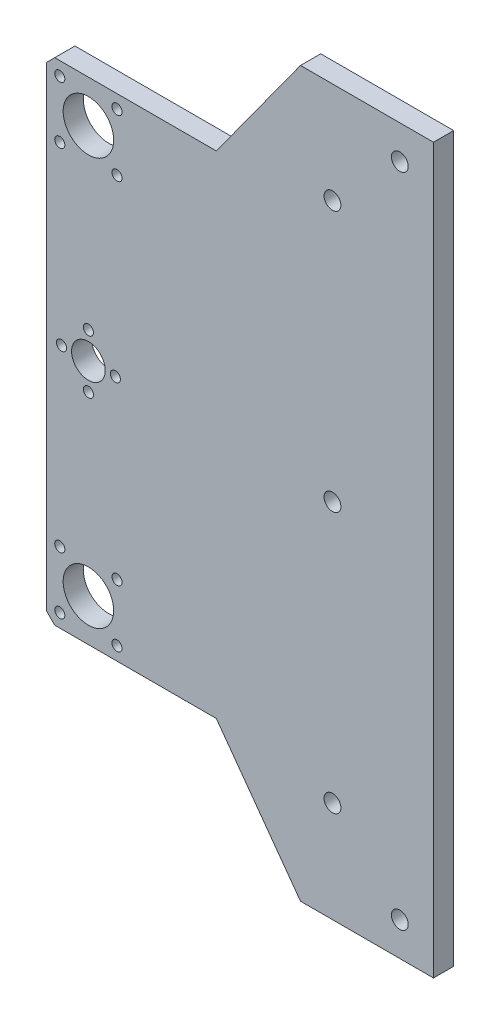
ISO-10303-21;
HEADER;
FILE_DESCRIPTION(('STEP AP214'),'2;1');
FILE_NAME('part.step','',(''),(''),'','','');
FILE_SCHEMA(('AUTOMOTIVE_DESIGN { 1 0 10303 214 1 1 1 1 }'));
ENDSEC;
DATA;
#1=APPLICATION_CONTEXT('core data for automotive mechanical design processes');
#2=APPLICATION_PROTOCOL_DEFINITION('international standard','automotive_design',2000,#1);
#3=PRODUCT_CONTEXT('',#1,'mechanical');
#4=PRODUCT('Part','Part','',(#3));
#5=PRODUCT_RELATED_PRODUCT_CATEGORY('part','',(#4));
#6=PRODUCT_DEFINITION_FORMATION('','',#4);
#7=PRODUCT_DEFINITION_CONTEXT('part definition',#1,'design');
#8=PRODUCT_DEFINITION('design','',#6,#7);
#9=PRODUCT_DEFINITION_SHAPE('','',#8);
#10=(LENGTH_UNIT() NAMED_UNIT(*) SI_UNIT(.MILLI.,.METRE.));
#11=(NAMED_UNIT(*) PLANE_ANGLE_UNIT() SI_UNIT($,.RADIAN.));
#12=(NAMED_UNIT(*) SI_UNIT($,.STERADIAN.) SOLID_ANGLE_UNIT());
#13=UNCERTAINTY_MEASURE_WITH_UNIT(LENGTH_MEASURE(1.E-05),#10,'distance_accuracy_value','');
#14=(GEOMETRIC_REPRESENTATION_CONTEXT(3) GLOBAL_UNCERTAINTY_ASSIGNED_CONTEXT((#13)) GLOBAL_UNIT_ASSIGNED_CONTEXT((#10,
#11,#12)) REPRESENTATION_CONTEXT('',''));
#15=CARTESIAN_POINT('',(0.,0.,0.));
#16=DIRECTION('',(0.,0.,1.));
#17=DIRECTION('',(1.,0.,0.));
#18=AXIS2_PLACEMENT_3D('',#15,#16,#17);
#19=CARTESIAN_POINT('',(-118.720197344261,118.720312676004,6.));
#20=DIRECTION('',(-0.707106437724189,0.707107124648739,0.));
#21=DIRECTION('',(-0.707107124648739,-0.707106437724189,0.));
#22=AXIS2_PLACEMENT_3D('',#19,#20,#21);
#23=PLANE('',#22);
#24=DIRECTION('',(0.707107124648739,0.707106437724189,0.));
#25=VECTOR('',#24,1.);
#26=CARTESIAN_POINT('',(-118.720197344261,118.720312676004,0.));
#27=LINE('',#26,#25);
#28=CARTESIAN_POINT('',(-114.885002048852,122.555504245684,0.));
#29=VERTEX_POINT('',#28);
#30=CARTESIAN_POINT('',(-112.385001966847,125.055501899045,0.));
#31=VERTEX_POINT('',#30);
#32=EDGE_CURVE('E236',#29,#31,#27,.T.);
#33=ORIENTED_EDGE('',*,*,#32,.F.);
#34=DIRECTION('',(0.,0.,-1.));
#35=VECTOR('',#34,1.);
#36=CARTESIAN_POINT('',(-114.885002048852,122.555504245684,6.));
#37=LINE('',#36,#35);
#38=CARTESIAN_POINT('',(-114.885002048852,122.555504245684,6.));
#39=VERTEX_POINT('',#38);
#40=EDGE_CURVE('E11',#39,#29,#37,.T.);
#41=ORIENTED_EDGE('',*,*,#40,.F.);
#42=DIRECTION('',(0.707107124648739,0.707106437724189,0.));
#43=VECTOR('',#42,1.);
#44=CARTESIAN_POINT('',(-118.720197344261,118.720312676004,6.));
#45=LINE('',#44,#43);
#46=CARTESIAN_POINT('',(-112.385001966847,125.055501899045,6.));
#47=VERTEX_POINT('',#46);
#48=EDGE_CURVE('E695',#39,#47,#45,.T.);
#49=ORIENTED_EDGE('',*,*,#48,.T.);
#50=DIRECTION('',(0.,0.,-1.));
#51=VECTOR('',#50,1.);
#52=CARTESIAN_POINT('',(-112.385001966847,125.055501899045,6.));
#53=LINE('',#52,#51);
#54=EDGE_CURVE('E59',#47,#31,#53,.T.);
#55=ORIENTED_EDGE('',*,*,#54,.T.);
#56=EDGE_LOOP('',(#33,#41,#49,#55));
#57=FACE_BOUND('',#56,.T.);
#58=ADVANCED_FACE('F41',(#57),#23,.T.);
#59=CARTESIAN_POINT('',(-114.885002048852,0.,6.));
#60=DIRECTION('',(1.,0.,0.));
#61=DIRECTION('',(0.,1.,0.));
#62=AXIS2_PLACEMENT_3D('',#59,#60,#61);
#63=PLANE('',#62);
#64=DIRECTION('',(0.,-1.,0.));
#65=VECTOR('',#64,1.);
#66=CARTESIAN_POINT('',(-114.885002048852,0.,0.));
#67=LINE('',#66,#65);
#68=CARTESIAN_POINT('',(-114.885002048852,-18.4444983769208,0.));
#69=VERTEX_POINT('',#68);
#70=EDGE_CURVE('E239',#29,#69,#67,.T.);
#71=ORIENTED_EDGE('',*,*,#70,.T.);
#72=DIRECTION('',(0.,0.,-1.));
#73=VECTOR('',#72,1.);
#74=CARTESIAN_POINT('',(-114.885002048852,-18.4444983769208,6.));
#75=LINE('',#74,#73);
#76=CARTESIAN_POINT('',(-114.885002048852,-18.4444983769208,6.));
#77=VERTEX_POINT('',#76);
#78=EDGE_CURVE('E51',#77,#69,#75,.T.);
#79=ORIENTED_EDGE('',*,*,#78,.F.);
#80=DIRECTION('',(0.,-1.,0.));
#81=VECTOR('',#80,1.);
#82=CARTESIAN_POINT('',(-114.885002048852,0.,6.));
#83=LINE('',#82,#81);
#84=EDGE_CURVE('E688',#39,#77,#83,.T.);
#85=ORIENTED_EDGE('',*,*,#84,.F.);
#86=ORIENTED_EDGE('',*,*,#40,.T.);
#87=EDGE_LOOP('',(#71,#79,#85,#86));
#88=FACE_BOUND('',#87,.T.);
#89=ADVANCED_FACE('F318',(#88),#63,.F.);
#90=CARTESIAN_POINT('',(-66.6647831207348,-66.6647449296042,6.));
#91=DIRECTION('',(0.707106983731355,0.707106578641682,0.));
#92=DIRECTION('',(-0.707106578641682,0.707106983731355,0.));
#93=AXIS2_PLACEMENT_3D('',#90,#91,#92);
#94=PLANE('',#93);
#95=DIRECTION('',(0.707106578641682,-0.707106983731355,0.));
#96=VECTOR('',#95,1.);
#97=CARTESIAN_POINT('',(-66.6647831207348,-66.6647449296042,0.));
#98=LINE('',#97,#96);
#99=CARTESIAN_POINT('',(-112.385002139956,-20.9444997180253,0.));
#100=VERTEX_POINT('',#99);
#101=EDGE_CURVE('E243',#69,#100,#98,.T.);
#102=ORIENTED_EDGE('',*,*,#101,.T.);
#103=DIRECTION('',(0.,0.,-1.));
#104=VECTOR('',#103,1.);
#105=CARTESIAN_POINT('',(-112.385002139956,-20.9444997180253,6.));
#106=LINE('',#105,#104);
#107=CARTESIAN_POINT('',(-112.385002139956,-20.9444997180253,6.));
#108=VERTEX_POINT('',#107);
#109=EDGE_CURVE('E306',#108,#100,#106,.T.);
#110=ORIENTED_EDGE('',*,*,#109,.F.);
#111=DIRECTION('',(0.707106578641682,-0.707106983731355,0.));
#112=VECTOR('',#111,1.);
#113=CARTESIAN_POINT('',(-66.6647831207348,-66.6647449296042,6.));
#114=LINE('',#113,#112);
#115=EDGE_CURVE('E314',#77,#108,#114,.T.);
#116=ORIENTED_EDGE('',*,*,#115,.F.);
#117=ORIENTED_EDGE('',*,*,#78,.T.);
#118=EDGE_LOOP('',(#102,#110,#116,#117));
#119=FACE_BOUND('',#118,.T.);
#120=ADVANCED_FACE('F312',(#119),#94,.F.);
#121=CARTESIAN_POINT('',(0.,-20.9444997180253,6.));
#122=DIRECTION('',(0.,-1.,0.));
#123=DIRECTION('',(0.,0.,-1.));
#124=AXIS2_PLACEMENT_3D('',#121,#122,#123);
#125=PLANE('',#124);
#126=DIRECTION('',(-1.,0.,0.));
#127=VECTOR('',#126,1.);
#128=CARTESIAN_POINT('',(0.,-20.9444997180253,0.));
#129=LINE('',#128,#127);
#130=CARTESIAN_POINT('',(-64.3850003257394,-20.9444997180253,0.));
#131=VERTEX_POINT('',#130);
#132=EDGE_CURVE('E247',#131,#100,#129,.T.);
#133=ORIENTED_EDGE('',*,*,#132,.F.);
#134=DIRECTION('',(0.,0.,-1.));
#135=VECTOR('',#134,1.);
#136=CARTESIAN_POINT('',(-64.3850003257394,-20.9444997180253,6.));
#137=LINE('',#136,#135);
#138=CARTESIAN_POINT('',(-64.3850003257394,-20.9444997180253,6.));
#139=VERTEX_POINT('',#138);
#140=EDGE_CURVE('E303',#139,#131,#137,.T.);
#141=ORIENTED_EDGE('',*,*,#140,.F.);
#142=DIRECTION('',(-1.,0.,0.));
#143=VECTOR('',#142,1.);
#144=CARTESIAN_POINT('',(0.,-20.9444997180253,6.));
#145=LINE('',#144,#143);
#146=EDGE_CURVE('E683',#139,#108,#145,.T.);
#147=ORIENTED_EDGE('',*,*,#146,.T.);
#148=ORIENTED_EDGE('',*,*,#109,.T.);
#149=EDGE_LOOP('',(#133,#141,#147,#148));
#150=FACE_BOUND('',#149,.T.);
#151=ADVANCED_FACE('F483',(#150),#125,.T.);
#152=CARTESIAN_POINT('',(-52.1685009762058,-37.8032665863785,6.));
#153=DIRECTION('',(0.809749805832477,0.586775299372992,0.));
#154=DIRECTION('',(-0.586775299372992,0.809749805832478,0.));
#155=AXIS2_PLACEMENT_3D('',#152,#153,#154);
#156=PLANE('',#155);
#157=DIRECTION('',(0.586775299372992,-0.809749805832478,0.));
#158=VECTOR('',#157,1.);
#159=CARTESIAN_POINT('',(-52.1685009762058,-37.8032665863785,0.));
#160=LINE('',#159,#158);
#161=CARTESIAN_POINT('',(-39.3849980905652,-55.4444982308727,0.));
#162=VERTEX_POINT('',#161);
#163=EDGE_CURVE('E251',#131,#162,#160,.T.);
#164=ORIENTED_EDGE('',*,*,#163,.T.);
#165=DIRECTION('',(0.,0.,-1.));
#166=VECTOR('',#165,1.);
#167=CARTESIAN_POINT('',(-39.3849980905652,-55.4444982308727,6.));
#168=LINE('',#167,#166);
#169=CARTESIAN_POINT('',(-39.3849980905652,-55.4444982308727,6.));
#170=VERTEX_POINT('',#169);
#171=EDGE_CURVE('E299',#170,#162,#168,.T.);
#172=ORIENTED_EDGE('',*,*,#171,.F.);
#173=DIRECTION('',(0.586775299372992,-0.809749805832478,0.));
#174=VECTOR('',#173,1.);
#175=CARTESIAN_POINT('',(-52.1685009762058,-37.8032665863785,6.));
#176=LINE('',#175,#174);
#177=EDGE_CURVE('E680',#139,#170,#176,.T.);
#178=ORIENTED_EDGE('',*,*,#177,.F.);
#179=ORIENTED_EDGE('',*,*,#140,.T.);
#180=EDGE_LOOP('',(#164,#172,#178,#179));
#181=FACE_BOUND('',#180,.T.);
#182=ADVANCED_FACE('F479',(#181),#156,.F.);
#183=CARTESIAN_POINT('',(0.,-55.4444982308727,6.));
#184=DIRECTION('',(0.,1.,0.));
#185=DIRECTION('',(0.,0.,1.));
#186=AXIS2_PLACEMENT_3D('',#183,#184,#185);
#187=PLANE('',#186);
#188=DIRECTION('',(1.,0.,0.));
#189=VECTOR('',#188,1.);
#190=CARTESIAN_POINT('',(0.,-55.4444982308727,0.));
#191=LINE('',#190,#189);
#192=CARTESIAN_POINT('',(0.115000002086169,-55.4444982308727,0.));
#193=VERTEX_POINT('',#192);
#194=EDGE_CURVE('E255',#162,#193,#191,.T.);
#195=ORIENTED_EDGE('',*,*,#194,.T.);
#196=DIRECTION('',(0.,0.,-1.));
#197=VECTOR('',#196,1.);
#198=CARTESIAN_POINT('',(0.115000002086169,-55.4444982308727,6.));
#199=LINE('',#198,#197);
#200=CARTESIAN_POINT('',(0.115000002086169,-55.4444982308727,6.));
#201=VERTEX_POINT('',#200);
#202=EDGE_CURVE('E295',#201,#193,#199,.T.);
#203=ORIENTED_EDGE('',*,*,#202,.F.);
#204=DIRECTION('',(1.,0.,0.));
#205=VECTOR('',#204,1.);
#206=CARTESIAN_POINT('',(0.,-55.4444982308727,6.));
#207=LINE('',#206,#205);
#208=EDGE_CURVE('E150',#170,#201,#207,.T.);
#209=ORIENTED_EDGE('',*,*,#208,.F.);
#210=ORIENTED_EDGE('',*,*,#171,.T.);
#211=EDGE_LOOP('',(#195,#203,#209,#210));
#212=FACE_BOUND('',#211,.T.);
#213=ADVANCED_FACE('F475',(#212),#187,.F.);
#214=CARTESIAN_POINT('',(0.115000002086169,0.,6.));
#215=DIRECTION('',(-1.,0.,0.));
#216=DIRECTION('',(0.,0.,1.));
#217=AXIS2_PLACEMENT_3D('',#214,#215,#216);
#218=PLANE('',#217);
#219=DIRECTION('',(0.,1.,0.));
#220=VECTOR('',#219,1.);
#221=CARTESIAN_POINT('',(0.115000002086169,0.,0.));
#222=LINE('',#221,#220);
#223=CARTESIAN_POINT('',(0.115000002086169,159.555504760068,0.));
#224=VERTEX_POINT('',#223);
#225=EDGE_CURVE('E259',#193,#224,#222,.T.);
#226=ORIENTED_EDGE('',*,*,#225,.T.);
#227=DIRECTION('',(0.,0.,-1.));
#228=VECTOR('',#227,1.);
#229=CARTESIAN_POINT('',(0.115000002086169,159.555504760068,6.));
#230=LINE('',#229,#228);
#231=CARTESIAN_POINT('',(0.115000002086169,159.555504760068,6.));
#232=VERTEX_POINT('',#231);
#233=EDGE_CURVE('E132',#232,#224,#230,.T.);
#234=ORIENTED_EDGE('',*,*,#233,.F.);
#235=DIRECTION('',(0.,1.,0.));
#236=VECTOR('',#235,1.);
#237=CARTESIAN_POINT('',(0.115000002086169,0.,6.));
#238=LINE('',#237,#236);
#239=EDGE_CURVE('E145',#201,#232,#238,.T.);
#240=ORIENTED_EDGE('',*,*,#239,.F.);
#241=ORIENTED_EDGE('',*,*,#202,.T.);
#242=EDGE_LOOP('',(#226,#234,#240,#241));
#243=FACE_BOUND('',#242,.T.);
#244=ADVANCED_FACE('F472',(#243),#218,.F.);
#245=CARTESIAN_POINT('',(0.,159.555504760068,6.));
#246=DIRECTION('',(0.,1.,0.));
#247=DIRECTION('',(0.,0.,1.));
#248=AXIS2_PLACEMENT_3D('',#245,#246,#247);
#249=PLANE('',#248);
#250=DIRECTION('',(1.,0.,0.));
#251=VECTOR('',#250,1.);
#252=CARTESIAN_POINT('',(0.,159.555504760068,0.));
#253=LINE('',#252,#251);
#254=CARTESIAN_POINT('',(-39.3850002457624,159.555504760068,0.));
#255=VERTEX_POINT('',#254);
#256=EDGE_CURVE('E128',#255,#224,#253,.T.);
#257=ORIENTED_EDGE('',*,*,#256,.F.);
#258=DIRECTION('',(0.,0.,-1.));
#259=VECTOR('',#258,1.);
#260=CARTESIAN_POINT('',(-39.3850002457624,159.555504760068,6.));
#261=LINE('',#260,#259);
#262=CARTESIAN_POINT('',(-39.3850002457624,159.555504760068,6.));
#263=VERTEX_POINT('',#262);
#264=EDGE_CURVE('E122',#263,#255,#261,.T.);
#265=ORIENTED_EDGE('',*,*,#264,.F.);
#266=DIRECTION('',(1.,0.,0.));
#267=VECTOR('',#266,1.);
#268=CARTESIAN_POINT('',(0.,159.555504760068,6.));
#269=LINE('',#268,#267);
#270=EDGE_CURVE('E126',#263,#232,#269,.T.);
#271=ORIENTED_EDGE('',*,*,#270,.T.);
#272=ORIENTED_EDGE('',*,*,#233,.T.);
#273=EDGE_LOOP('',(#257,#265,#271,#272));
#274=FACE_BOUND('',#273,.T.);
#275=ADVANCED_FACE('F124',(#274),#249,.T.);
#276=CARTESIAN_POINT('',(-101.635928641547,73.6492241304512,6.));
#277=DIRECTION('',(0.809749840970915,-0.586775250881952,0.));
#278=DIRECTION('',(0.586775250881952,0.809749840970915,0.));
#279=AXIS2_PLACEMENT_3D('',#276,#277,#278);
#280=PLANE('',#279);
#281=DIRECTION('',(-0.586775250881952,-0.809749840970915,0.));
#282=VECTOR('',#281,1.);
#283=CARTESIAN_POINT('',(-101.635928641547,73.6492241304512,0.));
#284=LINE('',#283,#282);
#285=CARTESIAN_POINT('',(-64.3850024809365,125.055501899045,0.));
#286=VERTEX_POINT('',#285);
#287=EDGE_CURVE('E265',#255,#286,#284,.T.);
#288=ORIENTED_EDGE('',*,*,#287,.T.);
#289=DIRECTION('',(0.,0.,-1.));
#290=VECTOR('',#289,1.);
#291=CARTESIAN_POINT('',(-64.3850024809365,125.055501899045,6.));
#292=LINE('',#291,#290);
#293=CARTESIAN_POINT('',(-64.3850024809365,125.055501899045,6.));
#294=VERTEX_POINT('',#293);
#295=EDGE_CURVE('E91',#294,#286,#292,.T.);
#296=ORIENTED_EDGE('',*,*,#295,.F.);
#297=DIRECTION('',(-0.586775250881952,-0.809749840970915,0.));
#298=VECTOR('',#297,1.);
#299=CARTESIAN_POINT('',(-101.635928641547,73.6492241304512,6.));
#300=LINE('',#299,#298);
#301=EDGE_CURVE('E134',#263,#294,#300,.T.);
#302=ORIENTED_EDGE('',*,*,#301,.F.);
#303=ORIENTED_EDGE('',*,*,#264,.T.);
#304=EDGE_LOOP('',(#288,#296,#302,#303));
#305=FACE_BOUND('',#304,.T.);
#306=ADVANCED_FACE('F135',(#305),#280,.F.);
#307=CARTESIAN_POINT('',(-102.385001897812,112.555506331846,6.));
#308=DIRECTION('',(0.,0.,-1.));
#309=DIRECTION('',(-1.,0.,0.));
#310=AXIS2_PLACEMENT_3D('',#307,#308,#309);
#311=CYLINDRICAL_SURFACE('',#310,7.49999945033653);
#312=CARTESIAN_POINT('',(-102.385001897812,112.555506331846,6.));
#313=DIRECTION('',(0.,0.,1.));
#314=DIRECTION('',(1.,0.,0.));
#315=AXIS2_PLACEMENT_3D('',#312,#313,#314);
#316=CIRCLE('',#315,7.49999945033653);
#317=CARTESIAN_POINT('',(-94.8850024474753,112.555506331846,6.));
#318=VERTEX_POINT('',#317);
#319=EDGE_CURVE('E164',#318,#318,#316,.F.);
#320=ORIENTED_EDGE('',*,*,#319,.F.);
#321=EDGE_LOOP('',(#320));
#322=FACE_BOUND('',#321,.T.);
#323=CARTESIAN_POINT('',(-102.385001897812,112.555506331846,0.));
#324=DIRECTION('',(0.,0.,1.));
#325=DIRECTION('',(1.,0.,0.));
#326=AXIS2_PLACEMENT_3D('',#323,#324,#325);
#327=CIRCLE('',#326,7.49999945033653);
#328=CARTESIAN_POINT('',(-94.8850024474753,112.555506331846,0.));
#329=VERTEX_POINT('',#328);
#330=EDGE_CURVE('E280',#329,#329,#327,.F.);
#331=ORIENTED_EDGE('',*,*,#330,.T.);
#332=EDGE_LOOP('',(#331));
#333=FACE_BOUND('',#332,.T.);
#334=ADVANCED_FACE('F454',(#322,#333),#311,.F.);
#335=CARTESIAN_POINT('',(-93.8850023671984,121.055504931137,6.));
#336=DIRECTION('',(0.,0.,-1.));
#337=DIRECTION('',(-1.,0.,0.));
#338=AXIS2_PLACEMENT_3D('',#335,#336,#337);
#339=CYLINDRICAL_SURFACE('',#338,1.50000026356073);
#340=CARTESIAN_POINT('',(-93.8850023671984,121.055504931137,6.));
#341=DIRECTION('',(0.,0.,1.));
#342=DIRECTION('',(1.,0.,0.));
#343=AXIS2_PLACEMENT_3D('',#340,#341,#342);
#344=CIRCLE('',#343,1.50000026356073);
#345=CARTESIAN_POINT('',(-92.3850021036377,121.055504931137,6.));
#346=VERTEX_POINT('',#345);
#347=EDGE_CURVE('E160',#346,#346,#344,.F.);
#348=ORIENTED_EDGE('',*,*,#347,.F.);
#349=EDGE_LOOP('',(#348));
#350=FACE_BOUND('',#349,.T.);
#351=CARTESIAN_POINT('',(-93.8850023671984,121.055504931137,0.));
#352=DIRECTION('',(0.,0.,1.));
#353=DIRECTION('',(1.,0.,0.));
#354=AXIS2_PLACEMENT_3D('',#351,#352,#353);
#355=CIRCLE('',#354,1.50000026356073);
#356=CARTESIAN_POINT('',(-92.3850021036377,121.055504931137,0.));
#357=VERTEX_POINT('',#356);
#358=EDGE_CURVE('E276',#357,#357,#355,.F.);
#359=ORIENTED_EDGE('',*,*,#358,.T.);
#360=EDGE_LOOP('',(#359));
#361=FACE_BOUND('',#360,.T.);
#362=ADVANCED_FACE('F457',(#350,#361),#339,.F.);
#363=CARTESIAN_POINT('',(-102.385000966489,44.0555053483695,6.));
#364=DIRECTION('',(0.,0.,-1.));
#365=DIRECTION('',(-1.,0.,0.));
#366=AXIS2_PLACEMENT_3D('',#363,#364,#365);
#367=CYLINDRICAL_SURFACE('',#366,1.50000026052179);
#368=CARTESIAN_POINT('',(-102.385000966489,44.0555053483695,6.));
#369=DIRECTION('',(0.,0.,1.));
#370=DIRECTION('',(1.,0.,0.));
#371=AXIS2_PLACEMENT_3D('',#368,#369,#370);
#372=CIRCLE('',#371,1.50000026052179);
#373=CARTESIAN_POINT('',(-100.885000705968,44.0555053483695,6.));
#374=VERTEX_POINT('',#373);
#375=EDGE_CURVE('E156',#374,#374,#372,.T.);
#376=ORIENTED_EDGE('',*,*,#375,.T.);
#377=EDGE_LOOP('',(#376));
#378=FACE_BOUND('',#377,.T.);
#379=CARTESIAN_POINT('',(-102.385000966489,44.0555053483695,0.));
#380=DIRECTION('',(0.,0.,1.));
#381=DIRECTION('',(1.,0.,0.));
#382=AXIS2_PLACEMENT_3D('',#379,#380,#381);
#383=CIRCLE('',#382,1.50000026052179);
#384=CARTESIAN_POINT('',(-100.885000705968,44.0555053483695,0.));
#385=VERTEX_POINT('',#384);
#386=EDGE_CURVE('E272',#385,#385,#383,.T.);
#387=ORIENTED_EDGE('',*,*,#386,.F.);
#388=EDGE_LOOP('',(#387));
#389=FACE_BOUND('',#388,.T.);
#390=ADVANCED_FACE('F461',(#378,#389),#367,.F.);
#391=CARTESIAN_POINT('',(0.,125.055501899045,6.));
#392=DIRECTION('',(0.,1.,0.));
#393=DIRECTION('',(0.,0.,1.));
#394=AXIS2_PLACEMENT_3D('',#391,#392,#393);
#395=PLANE('',#394);
#396=DIRECTION('',(1.,0.,0.));
#397=VECTOR('',#396,1.);
#398=CARTESIAN_POINT('',(0.,125.055501899045,0.));
#399=LINE('',#398,#397);
#400=EDGE_CURVE('E268',#31,#286,#399,.T.);
#401=ORIENTED_EDGE('',*,*,#400,.F.);
#402=ORIENTED_EDGE('',*,*,#54,.F.);
#403=DIRECTION('',(1.,0.,0.));
#404=VECTOR('',#403,1.);
#405=CARTESIAN_POINT('',(0.,125.055501899045,6.));
#406=LINE('',#405,#404);
#407=EDGE_CURVE('E139',#47,#294,#406,.T.);
#408=ORIENTED_EDGE('',*,*,#407,.T.);
#409=ORIENTED_EDGE('',*,*,#295,.T.);
#410=EDGE_LOOP('',(#401,#402,#408,#409));
#411=FACE_BOUND('',#410,.T.);
#412=ADVANCED_FACE('F334',(#411),#395,.T.);
#413=CARTESIAN_POINT('',(-102.385000966489,60.0555042456836,6.));
#414=DIRECTION('',(0.,0.,-1.));
#415=DIRECTION('',(-1.,0.,0.));
#416=AXIS2_PLACEMENT_3D('',#413,#414,#415);
#417=CYLINDRICAL_SURFACE('',#416,1.50000040224866);
#418=CARTESIAN_POINT('',(-102.385000966489,60.0555042456836,6.));
#419=DIRECTION('',(0.,0.,1.));
#420=DIRECTION('',(1.,0.,0.));
#421=AXIS2_PLACEMENT_3D('',#418,#419,#420);
#422=CIRCLE('',#421,1.50000040224866);
#423=CARTESIAN_POINT('',(-100.885000564241,60.0555042456836,6.));
#424=VERTEX_POINT('',#423);
#425=EDGE_CURVE('E698',#424,#424,#422,.T.);
#426=ORIENTED_EDGE('',*,*,#425,.T.);
#427=EDGE_LOOP('',(#426));
#428=FACE_BOUND('',#427,.T.);
#429=CARTESIAN_POINT('',(-102.385000966489,60.0555042456836,0.));
#430=DIRECTION('',(0.,0.,1.));
#431=DIRECTION('',(1.,0.,0.));
#432=AXIS2_PLACEMENT_3D('',#429,#430,#431);
#433=CIRCLE('',#432,1.50000040224866);
#434=CARTESIAN_POINT('',(-100.885000564241,60.0555042456836,0.));
#435=VERTEX_POINT('',#434);
#436=EDGE_CURVE('E232',#435,#435,#433,.T.);
#437=ORIENTED_EDGE('',*,*,#436,.F.);
#438=EDGE_LOOP('',(#437));
#439=FACE_BOUND('',#438,.T.);
#440=ADVANCED_FACE('F330',(#428,#439),#417,.F.);
#441=CARTESIAN_POINT('',(-29.8850011900067,129.555503530428,6.));
#442=DIRECTION('',(0.,0.,-1.));
#443=DIRECTION('',(-1.,0.,0.));
#444=AXIS2_PLACEMENT_3D('',#441,#442,#443);
#445=CYLINDRICAL_SURFACE('',#444,2.50000027747509);
#446=CARTESIAN_POINT('',(-29.8850011900067,129.555503530428,6.));
#447=DIRECTION('',(0.,0.,1.));
#448=DIRECTION('',(1.,0.,0.));
#449=AXIS2_PLACEMENT_3D('',#446,#447,#448);
#450=CIRCLE('',#449,2.50000027747509);
#451=CARTESIAN_POINT('',(-27.3850009125316,129.555503530428,6.));
#452=VERTEX_POINT('',#451);
#453=EDGE_CURVE('E702',#452,#452,#450,.T.);
#454=ORIENTED_EDGE('',*,*,#453,.T.);
#455=EDGE_LOOP('',(#454));
#456=FACE_BOUND('',#455,.T.);
#457=CARTESIAN_POINT('',(-29.8850011900067,129.555503530428,0.));
#458=DIRECTION('',(0.,0.,1.));
#459=DIRECTION('',(1.,0.,0.));
#460=AXIS2_PLACEMENT_3D('',#457,#458,#459);
#461=CIRCLE('',#460,2.50000027747509);
#462=CARTESIAN_POINT('',(-27.3850009125316,129.555503530428,0.));
#463=VERTEX_POINT('',#462);
#464=EDGE_CURVE('E228',#463,#463,#461,.T.);
#465=ORIENTED_EDGE('',*,*,#464,.F.);
#466=EDGE_LOOP('',(#465));
#467=FACE_BOUND('',#466,.T.);
#468=ADVANCED_FACE('F333',(#456,#467),#445,.F.);
#469=CARTESIAN_POINT('',(-9.88500163704156,149.555499358103,6.));
#470=DIRECTION('',(0.,0.,-1.));
#471=DIRECTION('',(-1.,0.,0.));
#472=AXIS2_PLACEMENT_3D('',#469,#470,#471);
#473=CYLINDRICAL_SURFACE('',#472,2.49999857418443);
#474=CARTESIAN_POINT('',(-9.88500163704156,149.555499358103,6.));
#475=DIRECTION('',(0.,0.,1.));
#476=DIRECTION('',(1.,0.,0.));
#477=AXIS2_PLACEMENT_3D('',#474,#475,#476);
#478=CIRCLE('',#477,2.49999857418443);
#479=CARTESIAN_POINT('',(-7.38500306285713,149.555499358103,6.));
#480=VERTEX_POINT('',#479);
#481=EDGE_CURVE('E706',#480,#480,#478,.T.);
#482=ORIENTED_EDGE('',*,*,#481,.T.);
#483=EDGE_LOOP('',(#482));
#484=FACE_BOUND('',#483,.T.);
#485=CARTESIAN_POINT('',(-9.88500163704156,149.555499358103,0.));
#486=DIRECTION('',(0.,0.,1.));
#487=DIRECTION('',(1.,0.,0.));
#488=AXIS2_PLACEMENT_3D('',#485,#486,#487);
#489=CIRCLE('',#488,2.49999857418443);
#490=CARTESIAN_POINT('',(-7.38500306285713,149.555499358103,0.));
#491=VERTEX_POINT('',#490);
#492=EDGE_CURVE('E224',#491,#491,#489,.T.);
#493=ORIENTED_EDGE('',*,*,#492,.F.);
#494=EDGE_LOOP('',(#493));
#495=FACE_BOUND('',#494,.T.);
#496=ADVANCED_FACE('F338',(#484,#495),#473,.F.);
#497=CARTESIAN_POINT('',(-29.8850011900067,52.0555029343814,6.));
#498=DIRECTION('',(0.,0.,-1.));
#499=DIRECTION('',(-1.,0.,0.));
#500=AXIS2_PLACEMENT_3D('',#497,#498,#499);
#501=CYLINDRICAL_SURFACE('',#500,2.49999761581421);
#502=CARTESIAN_POINT('',(-29.8850011900067,52.0555029343814,6.));
#503=DIRECTION('',(0.,0.,1.));
#504=DIRECTION('',(1.,0.,0.));
#505=AXIS2_PLACEMENT_3D('',#502,#503,#504);
#506=CIRCLE('',#505,2.49999761581421);
#507=CARTESIAN_POINT('',(-27.3850035741925,52.0555029343814,6.));
#508=VERTEX_POINT('',#507);
#509=EDGE_CURVE('E710',#508,#508,#506,.T.);
#510=ORIENTED_EDGE('',*,*,#509,.T.);
#511=EDGE_LOOP('',(#510));
#512=FACE_BOUND('',#511,.T.);
#513=CARTESIAN_POINT('',(-29.8850011900067,52.0555029343814,0.));
#514=DIRECTION('',(0.,0.,1.));
#515=DIRECTION('',(1.,0.,0.));
#516=AXIS2_PLACEMENT_3D('',#513,#514,#515);
#517=CIRCLE('',#516,2.49999761581421);
#518=CARTESIAN_POINT('',(-27.3850035741925,52.0555029343814,0.));
#519=VERTEX_POINT('',#518);
#520=EDGE_CURVE('E220',#519,#519,#517,.T.);
#521=ORIENTED_EDGE('',*,*,#520,.F.);
#522=EDGE_LOOP('',(#521));
#523=FACE_BOUND('',#522,.T.);
#524=ADVANCED_FACE('F342',(#512,#523),#501,.F.);
#525=CARTESIAN_POINT('',(-93.8850023671985,-16.9444990623742,6.));
#526=DIRECTION('',(0.,0.,-1.));
#527=DIRECTION('',(-1.,0.,0.));
#528=AXIS2_PLACEMENT_3D('',#525,#526,#527);
#529=CYLINDRICAL_SURFACE('',#528,1.50000026356073);
#530=CARTESIAN_POINT('',(-93.8850023671985,-16.9444990623742,6.));
#531=DIRECTION('',(0.,0.,1.));
#532=DIRECTION('',(1.,0.,0.));
#533=AXIS2_PLACEMENT_3D('',#530,#531,#532);
#534=CIRCLE('',#533,1.50000026356073);
#535=CARTESIAN_POINT('',(-92.3850021036377,-16.9444990623742,6.));
#536=VERTEX_POINT('',#535);
#537=EDGE_CURVE('E714',#536,#536,#534,.T.);
#538=ORIENTED_EDGE('',*,*,#537,.T.);
#539=EDGE_LOOP('',(#538));
#540=FACE_BOUND('',#539,.T.);
#541=CARTESIAN_POINT('',(-93.8850023671985,-16.9444990623742,0.));
#542=DIRECTION('',(0.,0.,1.));
#543=DIRECTION('',(1.,0.,0.));
#544=AXIS2_PLACEMENT_3D('',#541,#542,#543);
#545=CIRCLE('',#544,1.50000026356073);
#546=CARTESIAN_POINT('',(-92.3850021036377,-16.9444990623742,0.));
#547=VERTEX_POINT('',#546);
#548=EDGE_CURVE('E216',#547,#547,#545,.T.);
#549=ORIENTED_EDGE('',*,*,#548,.F.);
#550=EDGE_LOOP('',(#549));
#551=FACE_BOUND('',#550,.T.);
#552=ADVANCED_FACE('F346',(#540,#551),#529,.F.);
#553=CARTESIAN_POINT('',(-9.88500536233186,-45.4444986116141,6.));
#554=DIRECTION('',(0.,0.,-1.));
#555=DIRECTION('',(-1.,0.,0.));
#556=AXIS2_PLACEMENT_3D('',#553,#554,#555);
#557=CYLINDRICAL_SURFACE('',#556,2.49999994412065);
#558=CARTESIAN_POINT('',(-9.88500536233186,-45.4444986116141,6.));
#559=DIRECTION('',(0.,0.,1.));
#560=DIRECTION('',(1.,0.,0.));
#561=AXIS2_PLACEMENT_3D('',#558,#559,#560);
#562=CIRCLE('',#561,2.49999994412065);
#563=CARTESIAN_POINT('',(-7.38500541821121,-45.4444986116141,6.));
#564=VERTEX_POINT('',#563);
#565=EDGE_CURVE('E718',#564,#564,#562,.T.);
#566=ORIENTED_EDGE('',*,*,#565,.T.);
#567=EDGE_LOOP('',(#566));
#568=FACE_BOUND('',#567,.T.);
#569=CARTESIAN_POINT('',(-9.88500536233186,-45.4444986116141,0.));
#570=DIRECTION('',(0.,0.,1.));
#571=DIRECTION('',(1.,0.,0.));
#572=AXIS2_PLACEMENT_3D('',#569,#570,#571);
#573=CIRCLE('',#572,2.49999994412065);
#574=CARTESIAN_POINT('',(-7.38500541821121,-45.4444986116141,0.));
#575=VERTEX_POINT('',#574);
#576=EDGE_CURVE('E212',#575,#575,#573,.T.);
#577=ORIENTED_EDGE('',*,*,#576,.F.);
#578=EDGE_LOOP('',(#577));
#579=FACE_BOUND('',#578,.T.);
#580=ADVANCED_FACE('F350',(#568,#579),#557,.F.);
#581=CARTESIAN_POINT('',(-29.885004915297,-25.4444985929877,6.));
#582=DIRECTION('',(0.,0.,-1.));
#583=DIRECTION('',(-1.,0.,0.));
#584=AXIS2_PLACEMENT_3D('',#581,#582,#583);
#585=CYLINDRICAL_SURFACE('',#584,2.50000066270456);
#586=CARTESIAN_POINT('',(-29.885004915297,-25.4444985929877,6.));
#587=DIRECTION('',(0.,0.,1.));
#588=DIRECTION('',(1.,0.,0.));
#589=AXIS2_PLACEMENT_3D('',#586,#587,#588);
#590=CIRCLE('',#589,2.50000066270456);
#591=CARTESIAN_POINT('',(-27.3850042525925,-25.4444985929877,6.));
#592=VERTEX_POINT('',#591);
#593=EDGE_CURVE('E722',#592,#592,#590,.T.);
#594=ORIENTED_EDGE('',*,*,#593,.T.);
#595=EDGE_LOOP('',(#594));
#596=FACE_BOUND('',#595,.T.);
#597=CARTESIAN_POINT('',(-29.885004915297,-25.4444985929877,0.));
#598=DIRECTION('',(0.,0.,1.));
#599=DIRECTION('',(1.,0.,0.));
#600=AXIS2_PLACEMENT_3D('',#597,#598,#599);
#601=CIRCLE('',#600,2.50000066270456);
#602=CARTESIAN_POINT('',(-27.3850042525925,-25.4444985929877,0.));
#603=VERTEX_POINT('',#602);
#604=EDGE_CURVE('E208',#603,#603,#601,.T.);
#605=ORIENTED_EDGE('',*,*,#604,.F.);
#606=EDGE_LOOP('',(#605));
#607=FACE_BOUND('',#606,.T.);
#608=ADVANCED_FACE('F354',(#596,#607),#585,.F.);
#609=CARTESIAN_POINT('',(-110.885002126917,-16.9445009250194,6.));
#610=DIRECTION('',(0.,0.,-1.));
#611=DIRECTION('',(-1.,0.,0.));
#612=AXIS2_PLACEMENT_3D('',#609,#610,#611);
#613=CYLINDRICAL_SURFACE('',#612,1.49999992002784);
#614=CARTESIAN_POINT('',(-110.885002126917,-16.9445009250194,6.));
#615=DIRECTION('',(0.,0.,1.));
#616=DIRECTION('',(1.,0.,0.));
#617=AXIS2_PLACEMENT_3D('',#614,#615,#616);
#618=CIRCLE('',#617,1.49999992002784);
#619=CARTESIAN_POINT('',(-109.385002206889,-16.9445009250194,6.));
#620=VERTEX_POINT('',#619);
#621=EDGE_CURVE('E726',#620,#620,#618,.T.);
#622=ORIENTED_EDGE('',*,*,#621,.T.);
#623=EDGE_LOOP('',(#622));
#624=FACE_BOUND('',#623,.T.);
#625=CARTESIAN_POINT('',(-110.885002126917,-16.9445009250194,0.));
#626=DIRECTION('',(0.,0.,1.));
#627=DIRECTION('',(1.,0.,0.));
#628=AXIS2_PLACEMENT_3D('',#625,#626,#627);
#629=CIRCLE('',#628,1.49999992002784);
#630=CARTESIAN_POINT('',(-109.385002206889,-16.9445009250194,0.));
#631=VERTEX_POINT('',#630);
#632=EDGE_CURVE('E204',#631,#631,#629,.T.);
#633=ORIENTED_EDGE('',*,*,#632,.F.);
#634=EDGE_LOOP('',(#633));
#635=FACE_BOUND('',#634,.T.);
#636=ADVANCED_FACE('F358',(#624,#635),#613,.F.);
#637=CARTESIAN_POINT('',(-102.385001897812,-8.44450046308338,6.));
#638=DIRECTION('',(0.,0.,-1.));
#639=DIRECTION('',(-1.,0.,0.));
#640=AXIS2_PLACEMENT_3D('',#637,#638,#639);
#641=CYLINDRICAL_SURFACE('',#640,7.49999945033653);
#642=CARTESIAN_POINT('',(-102.385001897812,-8.44450046308338,6.));
#643=DIRECTION('',(0.,0.,1.));
#644=DIRECTION('',(1.,0.,0.));
#645=AXIS2_PLACEMENT_3D('',#642,#643,#644);
#646=CIRCLE('',#645,7.49999945033653);
#647=CARTESIAN_POINT('',(-94.8850024474754,-8.44450046308338,6.));
#648=VERTEX_POINT('',#647);
#649=EDGE_CURVE('E730',#648,#648,#646,.T.);
#650=ORIENTED_EDGE('',*,*,#649,.T.);
#651=EDGE_LOOP('',(#650));
#652=FACE_BOUND('',#651,.T.);
#653=CARTESIAN_POINT('',(-102.385001897812,-8.44450046308338,0.));
#654=DIRECTION('',(0.,0.,1.));
#655=DIRECTION('',(1.,0.,0.));
#656=AXIS2_PLACEMENT_3D('',#653,#654,#655);
#657=CIRCLE('',#656,7.49999945033653);
#658=CARTESIAN_POINT('',(-94.8850024474754,-8.44450046308338,0.));
#659=VERTEX_POINT('',#658);
#660=EDGE_CURVE('E200',#659,#659,#657,.T.);
#661=ORIENTED_EDGE('',*,*,#660,.F.);
#662=EDGE_LOOP('',(#661));
#663=FACE_BOUND('',#662,.T.);
#664=ADVANCED_FACE('F362',(#652,#663),#641,.F.);
#665=CARTESIAN_POINT('',(-93.8850014358759,0.0554999988526192,6.));
#666=DIRECTION('',(0.,0.,-1.));
#667=DIRECTION('',(-1.,0.,0.));
#668=AXIS2_PLACEMENT_3D('',#665,#666,#667);
#669=CYLINDRICAL_SURFACE('',#668,1.50000029802998);
#670=CARTESIAN_POINT('',(-93.8850014358759,0.0554999988526192,6.));
#671=DIRECTION('',(0.,0.,1.));
#672=DIRECTION('',(1.,0.,0.));
#673=AXIS2_PLACEMENT_3D('',#670,#671,#672);
#674=CIRCLE('',#673,1.50000029802998);
#675=CARTESIAN_POINT('',(-92.3850011378459,0.0554999988526192,6.));
#676=VERTEX_POINT('',#675);
#677=EDGE_CURVE('E734',#676,#676,#674,.T.);
#678=ORIENTED_EDGE('',*,*,#677,.T.);
#679=EDGE_LOOP('',(#678));
#680=FACE_BOUND('',#679,.T.);
#681=CARTESIAN_POINT('',(-93.8850014358759,0.0554999988526192,0.));
#682=DIRECTION('',(0.,0.,1.));
#683=DIRECTION('',(1.,0.,0.));
#684=AXIS2_PLACEMENT_3D('',#681,#682,#683);
#685=CIRCLE('',#684,1.50000029802998);
#686=CARTESIAN_POINT('',(-92.3850011378459,0.0554999988526192,0.));
#687=VERTEX_POINT('',#686);
#688=EDGE_CURVE('E196',#687,#687,#685,.T.);
#689=ORIENTED_EDGE('',*,*,#688,.F.);
#690=EDGE_LOOP('',(#689));
#691=FACE_BOUND('',#690,.T.);
#692=ADVANCED_FACE('F366',(#680,#691),#669,.F.);
#693=CARTESIAN_POINT('',(-110.885001777671,0.0554999988526261,6.));
#694=DIRECTION('',(0.,0.,-1.));
#695=DIRECTION('',(-1.,0.,0.));
#696=AXIS2_PLACEMENT_3D('',#693,#694,#695);
#697=CYLINDRICAL_SURFACE('',#696,1.49999964846352);
#698=CARTESIAN_POINT('',(-110.885001777671,0.0554999988526261,6.));
#699=DIRECTION('',(0.,0.,1.));
#700=DIRECTION('',(1.,0.,0.));
#701=AXIS2_PLACEMENT_3D('',#698,#699,#700);
#702=CIRCLE('',#701,1.49999964846352);
#703=CARTESIAN_POINT('',(-109.385002129208,0.0554999988526261,6.));
#704=VERTEX_POINT('',#703);
#705=EDGE_CURVE('E738',#704,#704,#702,.T.);
#706=ORIENTED_EDGE('',*,*,#705,.T.);
#707=EDGE_LOOP('',(#706));
#708=FACE_BOUND('',#707,.T.);
#709=CARTESIAN_POINT('',(-110.885001777671,0.0554999988526261,0.));
#710=DIRECTION('',(0.,0.,1.));
#711=DIRECTION('',(1.,0.,0.));
#712=AXIS2_PLACEMENT_3D('',#709,#710,#711);
#713=CIRCLE('',#712,1.49999964846352);
#714=CARTESIAN_POINT('',(-109.385002129208,0.0554999988526261,0.));
#715=VERTEX_POINT('',#714);
#716=EDGE_CURVE('E192',#715,#715,#713,.T.);
#717=ORIENTED_EDGE('',*,*,#716,.F.);
#718=EDGE_LOOP('',(#717));
#719=FACE_BOUND('',#718,.T.);
#720=ADVANCED_FACE('F370',(#708,#719),#697,.F.);
#721=CARTESIAN_POINT('',(-110.885002126917,121.055506793782,6.));
#722=DIRECTION('',(0.,0.,-1.));
#723=DIRECTION('',(-1.,0.,0.));
#724=AXIS2_PLACEMENT_3D('',#721,#722,#723);
#725=CYLINDRICAL_SURFACE('',#724,1.49999992002785);
#726=CARTESIAN_POINT('',(-110.885002126917,121.055506793782,6.));
#727=DIRECTION('',(0.,0.,1.));
#728=DIRECTION('',(1.,0.,0.));
#729=AXIS2_PLACEMENT_3D('',#726,#727,#728);
#730=CIRCLE('',#729,1.49999992002785);
#731=CARTESIAN_POINT('',(-109.385002206889,121.055506793782,6.));
#732=VERTEX_POINT('',#731);
#733=EDGE_CURVE('E742',#732,#732,#730,.F.);
#734=ORIENTED_EDGE('',*,*,#733,.F.);
#735=EDGE_LOOP('',(#734));
#736=FACE_BOUND('',#735,.T.);
#737=CARTESIAN_POINT('',(-110.885002126917,121.055506793782,0.));
#738=DIRECTION('',(0.,0.,1.));
#739=DIRECTION('',(1.,0.,0.));
#740=AXIS2_PLACEMENT_3D('',#737,#738,#739);
#741=CIRCLE('',#740,1.49999992002785);
#742=CARTESIAN_POINT('',(-109.385002206889,121.055506793782,0.));
#743=VERTEX_POINT('',#742);
#744=EDGE_CURVE('E188',#743,#743,#741,.F.);
#745=ORIENTED_EDGE('',*,*,#744,.T.);
#746=EDGE_LOOP('',(#745));
#747=FACE_BOUND('',#746,.T.);
#748=ADVANCED_FACE('F374',(#736,#747),#725,.F.);
#749=CARTESIAN_POINT('',(-93.8850014358759,104.05550586991,6.));
#750=DIRECTION('',(0.,0.,-1.));
#751=DIRECTION('',(-1.,0.,0.));
#752=AXIS2_PLACEMENT_3D('',#749,#750,#751);
#753=CYLINDRICAL_SURFACE('',#752,1.50000029802998);
#754=CARTESIAN_POINT('',(-93.8850014358759,104.05550586991,6.));
#755=DIRECTION('',(0.,0.,1.));
#756=DIRECTION('',(1.,0.,0.));
#757=AXIS2_PLACEMENT_3D('',#754,#755,#756);
#758=CIRCLE('',#757,1.50000029802998);
#759=CARTESIAN_POINT('',(-92.3850011378459,104.05550586991,6.));
#760=VERTEX_POINT('',#759);
#761=EDGE_CURVE('E746',#760,#760,#758,.F.);
#762=ORIENTED_EDGE('',*,*,#761,.F.);
#763=EDGE_LOOP('',(#762));
#764=FACE_BOUND('',#763,.T.);
#765=CARTESIAN_POINT('',(-93.8850014358759,104.05550586991,0.));
#766=DIRECTION('',(0.,0.,1.));
#767=DIRECTION('',(1.,0.,0.));
#768=AXIS2_PLACEMENT_3D('',#765,#766,#767);
#769=CIRCLE('',#768,1.50000029802998);
#770=CARTESIAN_POINT('',(-92.3850011378459,104.05550586991,0.));
#771=VERTEX_POINT('',#770);
#772=EDGE_CURVE('E184',#771,#771,#769,.F.);
#773=ORIENTED_EDGE('',*,*,#772,.T.);
#774=EDGE_LOOP('',(#773));
#775=FACE_BOUND('',#774,.T.);
#776=ADVANCED_FACE('F378',(#764,#775),#753,.F.);
#777=CARTESIAN_POINT('',(-110.385000997223,52.0555029343814,6.));
#778=DIRECTION('',(0.,0.,-1.));
#779=DIRECTION('',(-1.,0.,0.));
#780=AXIS2_PLACEMENT_3D('',#777,#778,#779);
#781=CYLINDRICAL_SURFACE('',#780,1.50000199113441);
#782=CARTESIAN_POINT('',(-110.385000997223,52.0555029343814,6.));
#783=DIRECTION('',(0.,0.,1.));
#784=DIRECTION('',(1.,0.,0.));
#785=AXIS2_PLACEMENT_3D('',#782,#783,#784);
#786=CIRCLE('',#785,1.50000199113441);
#787=CARTESIAN_POINT('',(-108.884999006089,52.0555029343814,6.));
#788=VERTEX_POINT('',#787);
#789=EDGE_CURVE('E750',#788,#788,#786,.T.);
#790=ORIENTED_EDGE('',*,*,#789,.T.);
#791=EDGE_LOOP('',(#790));
#792=FACE_BOUND('',#791,.T.);
#793=CARTESIAN_POINT('',(-110.385000997223,52.0555029343814,0.));
#794=DIRECTION('',(0.,0.,1.));
#795=DIRECTION('',(1.,0.,0.));
#796=AXIS2_PLACEMENT_3D('',#793,#794,#795);
#797=CIRCLE('',#796,1.50000199113441);
#798=CARTESIAN_POINT('',(-108.884999006089,52.0555029343814,0.));
#799=VERTEX_POINT('',#798);
#800=EDGE_CURVE('E180',#799,#799,#797,.T.);
#801=ORIENTED_EDGE('',*,*,#800,.F.);
#802=EDGE_LOOP('',(#801));
#803=FACE_BOUND('',#802,.T.);
#804=ADVANCED_FACE('F382',(#792,#803),#781,.F.);
#805=CARTESIAN_POINT('',(-102.385000966489,52.0555029343814,6.));
#806=DIRECTION('',(0.,0.,-1.));
#807=DIRECTION('',(-1.,0.,0.));
#808=AXIS2_PLACEMENT_3D('',#805,#806,#807);
#809=CYLINDRICAL_SURFACE('',#808,5.00000130710432);
#810=CARTESIAN_POINT('',(-102.385000966489,52.0555029343814,6.));
#811=DIRECTION('',(0.,0.,1.));
#812=DIRECTION('',(1.,0.,0.));
#813=AXIS2_PLACEMENT_3D('',#810,#811,#812);
#814=CIRCLE('',#813,5.00000130710432);
#815=CARTESIAN_POINT('',(-97.384999659385,52.0555029343814,6.));
#816=VERTEX_POINT('',#815);
#817=EDGE_CURVE('E397',#816,#816,#814,.T.);
#818=ORIENTED_EDGE('',*,*,#817,.T.);
#819=EDGE_LOOP('',(#818));
#820=FACE_BOUND('',#819,.T.);
#821=CARTESIAN_POINT('',(-102.385000966489,52.0555029343814,0.));
#822=DIRECTION('',(0.,0.,1.));
#823=DIRECTION('',(1.,0.,0.));
#824=AXIS2_PLACEMENT_3D('',#821,#822,#823);
#825=CIRCLE('',#824,5.00000130710432);
#826=CARTESIAN_POINT('',(-97.384999659385,52.0555029343814,0.));
#827=VERTEX_POINT('',#826);
#828=EDGE_CURVE('E176',#827,#827,#825,.T.);
#829=ORIENTED_EDGE('',*,*,#828,.F.);
#830=EDGE_LOOP('',(#829));
#831=FACE_BOUND('',#830,.T.);
#832=ADVANCED_FACE('F385',(#820,#831),#809,.F.);
#833=CARTESIAN_POINT('',(-94.3850015178323,52.0555029343814,6.));
#834=DIRECTION('',(0.,0.,-1.));
#835=DIRECTION('',(-1.,0.,0.));
#836=AXIS2_PLACEMENT_3D('',#833,#834,#835);
#837=CYLINDRICAL_SURFACE('',#836,1.50000280197323);
#838=CARTESIAN_POINT('',(-94.3850015178323,52.0555029343814,6.));
#839=DIRECTION('',(0.,0.,1.));
#840=DIRECTION('',(1.,0.,0.));
#841=AXIS2_PLACEMENT_3D('',#838,#839,#840);
#842=CIRCLE('',#841,1.50000280197323);
#843=CARTESIAN_POINT('',(-92.8849987158591,52.0555029343814,6.));
#844=VERTEX_POINT('',#843);
#845=EDGE_CURVE('E288',#844,#844,#842,.T.);
#846=ORIENTED_EDGE('',*,*,#845,.T.);
#847=EDGE_LOOP('',(#846));
#848=FACE_BOUND('',#847,.T.);
#849=CARTESIAN_POINT('',(-94.3850015178323,52.0555029343814,0.));
#850=DIRECTION('',(0.,0.,1.));
#851=DIRECTION('',(1.,0.,0.));
#852=AXIS2_PLACEMENT_3D('',#849,#850,#851);
#853=CIRCLE('',#852,1.50000280197323);
#854=CARTESIAN_POINT('',(-92.8849987158591,52.0555029343814,0.));
#855=VERTEX_POINT('',#854);
#856=EDGE_CURVE('E172',#855,#855,#853,.T.);
#857=ORIENTED_EDGE('',*,*,#856,.F.);
#858=EDGE_LOOP('',(#857));
#859=FACE_BOUND('',#858,.T.);
#860=ADVANCED_FACE('F43',(#848,#859),#837,.F.);
#861=CARTESIAN_POINT('',(-110.885001777671,104.05550586991,6.));
#862=DIRECTION('',(0.,0.,-1.));
#863=DIRECTION('',(-1.,0.,0.));
#864=AXIS2_PLACEMENT_3D('',#861,#862,#863);
#865=CYLINDRICAL_SURFACE('',#864,1.49999964846352);
#866=CARTESIAN_POINT('',(-110.885001777671,104.05550586991,6.));
#867=DIRECTION('',(0.,0.,1.));
#868=DIRECTION('',(1.,0.,0.));
#869=AXIS2_PLACEMENT_3D('',#866,#867,#868);
#870=CIRCLE('',#869,1.49999964846352);
#871=CARTESIAN_POINT('',(-109.385002129208,104.05550586991,6.));
#872=VERTEX_POINT('',#871);
#873=EDGE_CURVE('E168',#872,#872,#870,.F.);
#874=ORIENTED_EDGE('',*,*,#873,.F.);
#875=EDGE_LOOP('',(#874));
#876=FACE_BOUND('',#875,.T.);
#877=CARTESIAN_POINT('',(-110.885001777671,104.05550586991,0.));
#878=DIRECTION('',(0.,0.,1.));
#879=DIRECTION('',(1.,0.,0.));
#880=AXIS2_PLACEMENT_3D('',#877,#878,#879);
#881=CIRCLE('',#880,1.49999964846352);
#882=CARTESIAN_POINT('',(-109.385002129208,104.05550586991,0.));
#883=VERTEX_POINT('',#882);
#884=EDGE_CURVE('E284',#883,#883,#881,.F.);
#885=ORIENTED_EDGE('',*,*,#884,.T.);
#886=EDGE_LOOP('',(#885));
#887=FACE_BOUND('',#886,.T.);
#888=ADVANCED_FACE('F392',(#876,#887),#865,.F.);
#889=CARTESIAN_POINT('',(0.,0.,6.));
#890=DIRECTION('',(0.,0.,1.));
#891=DIRECTION('',(1.,0.,0.));
#892=AXIS2_PLACEMENT_3D('',#889,#890,#891);
#893=PLANE('',#892);
#894=ORIENTED_EDGE('',*,*,#845,.F.);
#895=EDGE_LOOP('',(#894));
#896=FACE_BOUND('',#895,.T.);
#897=ORIENTED_EDGE('',*,*,#817,.F.);
#898=EDGE_LOOP('',(#897));
#899=FACE_BOUND('',#898,.T.);
#900=ORIENTED_EDGE('',*,*,#789,.F.);
#901=EDGE_LOOP('',(#900));
#902=FACE_BOUND('',#901,.T.);
#903=ORIENTED_EDGE('',*,*,#761,.T.);
#904=EDGE_LOOP('',(#903));
#905=FACE_BOUND('',#904,.T.);
#906=ORIENTED_EDGE('',*,*,#733,.T.);
#907=EDGE_LOOP('',(#906));
#908=FACE_BOUND('',#907,.T.);
#909=ORIENTED_EDGE('',*,*,#705,.F.);
#910=EDGE_LOOP('',(#909));
#911=FACE_BOUND('',#910,.T.);
#912=ORIENTED_EDGE('',*,*,#677,.F.);
#913=EDGE_LOOP('',(#912));
#914=FACE_BOUND('',#913,.T.);
#915=ORIENTED_EDGE('',*,*,#649,.F.);
#916=EDGE_LOOP('',(#915));
#917=FACE_BOUND('',#916,.T.);
#918=ORIENTED_EDGE('',*,*,#621,.F.);
#919=EDGE_LOOP('',(#918));
#920=FACE_BOUND('',#919,.T.);
#921=ORIENTED_EDGE('',*,*,#593,.F.);
#922=EDGE_LOOP('',(#921));
#923=FACE_BOUND('',#922,.T.);
#924=ORIENTED_EDGE('',*,*,#565,.F.);
#925=EDGE_LOOP('',(#924));
#926=FACE_BOUND('',#925,.T.);
#927=ORIENTED_EDGE('',*,*,#537,.F.);
#928=EDGE_LOOP('',(#927));
#929=FACE_BOUND('',#928,.T.);
#930=ORIENTED_EDGE('',*,*,#509,.F.);
#931=EDGE_LOOP('',(#930));
#932=FACE_BOUND('',#931,.T.);
#933=ORIENTED_EDGE('',*,*,#481,.F.);
#934=EDGE_LOOP('',(#933));
#935=FACE_BOUND('',#934,.T.);
#936=ORIENTED_EDGE('',*,*,#453,.F.);
#937=EDGE_LOOP('',(#936));
#938=FACE_BOUND('',#937,.T.);
#939=ORIENTED_EDGE('',*,*,#425,.F.);
#940=EDGE_LOOP('',(#939));
#941=FACE_BOUND('',#940,.T.);
#942=ORIENTED_EDGE('',*,*,#48,.F.);
#943=ORIENTED_EDGE('',*,*,#84,.T.);
#944=ORIENTED_EDGE('',*,*,#115,.T.);
#945=ORIENTED_EDGE('',*,*,#146,.F.);
#946=ORIENTED_EDGE('',*,*,#177,.T.);
#947=ORIENTED_EDGE('',*,*,#208,.T.);
#948=ORIENTED_EDGE('',*,*,#239,.T.);
#949=ORIENTED_EDGE('',*,*,#270,.F.);
#950=ORIENTED_EDGE('',*,*,#301,.T.);
#951=ORIENTED_EDGE('',*,*,#407,.F.);
#952=EDGE_LOOP('',(#942,#943,#944,#945,#946,#947,#948,#949,#950,#951));
#953=FACE_BOUND('',#952,.T.);
#954=ORIENTED_EDGE('',*,*,#375,.F.);
#955=EDGE_LOOP('',(#954));
#956=FACE_BOUND('',#955,.T.);
#957=ORIENTED_EDGE('',*,*,#347,.T.);
#958=EDGE_LOOP('',(#957));
#959=FACE_BOUND('',#958,.T.);
#960=ORIENTED_EDGE('',*,*,#319,.T.);
#961=EDGE_LOOP('',(#960));
#962=FACE_BOUND('',#961,.T.);
#963=ORIENTED_EDGE('',*,*,#873,.T.);
#964=EDGE_LOOP('',(#963));
#965=FACE_BOUND('',#964,.T.);
#966=ADVANCED_FACE('F142',(#896,#899,#902,#905,#908,#911,#914,#917,#920,#923,#926,#929,#932,
#935,#938,#941,#953,#956,#959,#962,#965),#893,.T.);
#967=CARTESIAN_POINT('',(0.,0.,0.));
#968=DIRECTION('',(0.,0.,1.));
#969=DIRECTION('',(1.,0.,0.));
#970=AXIS2_PLACEMENT_3D('',#967,#968,#969);
#971=PLANE('',#970);
#972=ORIENTED_EDGE('',*,*,#856,.T.);
#973=EDGE_LOOP('',(#972));
#974=FACE_BOUND('',#973,.T.);
#975=ORIENTED_EDGE('',*,*,#828,.T.);
#976=EDGE_LOOP('',(#975));
#977=FACE_BOUND('',#976,.T.);
#978=ORIENTED_EDGE('',*,*,#800,.T.);
#979=EDGE_LOOP('',(#978));
#980=FACE_BOUND('',#979,.T.);
#981=ORIENTED_EDGE('',*,*,#772,.F.);
#982=EDGE_LOOP('',(#981));
#983=FACE_BOUND('',#982,.T.);
#984=ORIENTED_EDGE('',*,*,#744,.F.);
#985=EDGE_LOOP('',(#984));
#986=FACE_BOUND('',#985,.T.);
#987=ORIENTED_EDGE('',*,*,#716,.T.);
#988=EDGE_LOOP('',(#987));
#989=FACE_BOUND('',#988,.T.);
#990=ORIENTED_EDGE('',*,*,#688,.T.);
#991=EDGE_LOOP('',(#990));
#992=FACE_BOUND('',#991,.T.);
#993=ORIENTED_EDGE('',*,*,#660,.T.);
#994=EDGE_LOOP('',(#993));
#995=FACE_BOUND('',#994,.T.);
#996=ORIENTED_EDGE('',*,*,#632,.T.);
#997=EDGE_LOOP('',(#996));
#998=FACE_BOUND('',#997,.T.);
#999=ORIENTED_EDGE('',*,*,#604,.T.);
#1000=EDGE_LOOP('',(#999));
#1001=FACE_BOUND('',#1000,.T.);
#1002=ORIENTED_EDGE('',*,*,#576,.T.);
#1003=EDGE_LOOP('',(#1002));
#1004=FACE_BOUND('',#1003,.T.);
#1005=ORIENTED_EDGE('',*,*,#548,.T.);
#1006=EDGE_LOOP('',(#1005));
#1007=FACE_BOUND('',#1006,.T.);
#1008=ORIENTED_EDGE('',*,*,#520,.T.);
#1009=EDGE_LOOP('',(#1008));
#1010=FACE_BOUND('',#1009,.T.);
#1011=ORIENTED_EDGE('',*,*,#492,.T.);
#1012=EDGE_LOOP('',(#1011));
#1013=FACE_BOUND('',#1012,.T.);
#1014=ORIENTED_EDGE('',*,*,#464,.T.);
#1015=EDGE_LOOP('',(#1014));
#1016=FACE_BOUND('',#1015,.T.);
#1017=ORIENTED_EDGE('',*,*,#436,.T.);
#1018=EDGE_LOOP('',(#1017));
#1019=FACE_BOUND('',#1018,.T.);
#1020=ORIENTED_EDGE('',*,*,#32,.T.);
#1021=ORIENTED_EDGE('',*,*,#400,.T.);
#1022=ORIENTED_EDGE('',*,*,#287,.F.);
#1023=ORIENTED_EDGE('',*,*,#256,.T.);
#1024=ORIENTED_EDGE('',*,*,#225,.F.);
#1025=ORIENTED_EDGE('',*,*,#194,.F.);
#1026=ORIENTED_EDGE('',*,*,#163,.F.);
#1027=ORIENTED_EDGE('',*,*,#132,.T.);
#1028=ORIENTED_EDGE('',*,*,#101,.F.);
#1029=ORIENTED_EDGE('',*,*,#70,.F.);
#1030=EDGE_LOOP('',(#1020,#1021,#1022,#1023,#1024,#1025,#1026,#1027,#1028,#1029));
#1031=FACE_BOUND('',#1030,.T.);
#1032=ORIENTED_EDGE('',*,*,#386,.T.);
#1033=EDGE_LOOP('',(#1032));
#1034=FACE_BOUND('',#1033,.T.);
#1035=ORIENTED_EDGE('',*,*,#358,.F.);
#1036=EDGE_LOOP('',(#1035));
#1037=FACE_BOUND('',#1036,.T.);
#1038=ORIENTED_EDGE('',*,*,#330,.F.);
#1039=EDGE_LOOP('',(#1038));
#1040=FACE_BOUND('',#1039,.T.);
#1041=ORIENTED_EDGE('',*,*,#884,.F.);
#1042=EDGE_LOOP('',(#1041));
#1043=FACE_BOUND('',#1042,.T.);
#1044=ADVANCED_FACE('F320',(#974,#977,#980,#983,#986,#989,#992,#995,#998,#1001,#1004,#1007,
#1010,#1013,#1016,#1019,#1031,#1034,#1037,#1040,#1043),#971,.F.);
#1045=CLOSED_SHELL('',(#58,#89,#120,#151,#182,#213,#244,#275,#306,#334,#362,#390,#412,#440,#468,
#496,#524,#552,#580,#608,#636,#664,#692,#720,#748,#776,#804,#832,#860,#888,#966,#1044));
#1046=MANIFOLD_SOLID_BREP('B2',#1045);
#1047=ADVANCED_BREP_SHAPE_REPRESENTATION('',(#18,#1046),#14);
#1048=SHAPE_DEFINITION_REPRESENTATION(#9,#1047);
ENDSEC;
END-ISO-10303-21;
